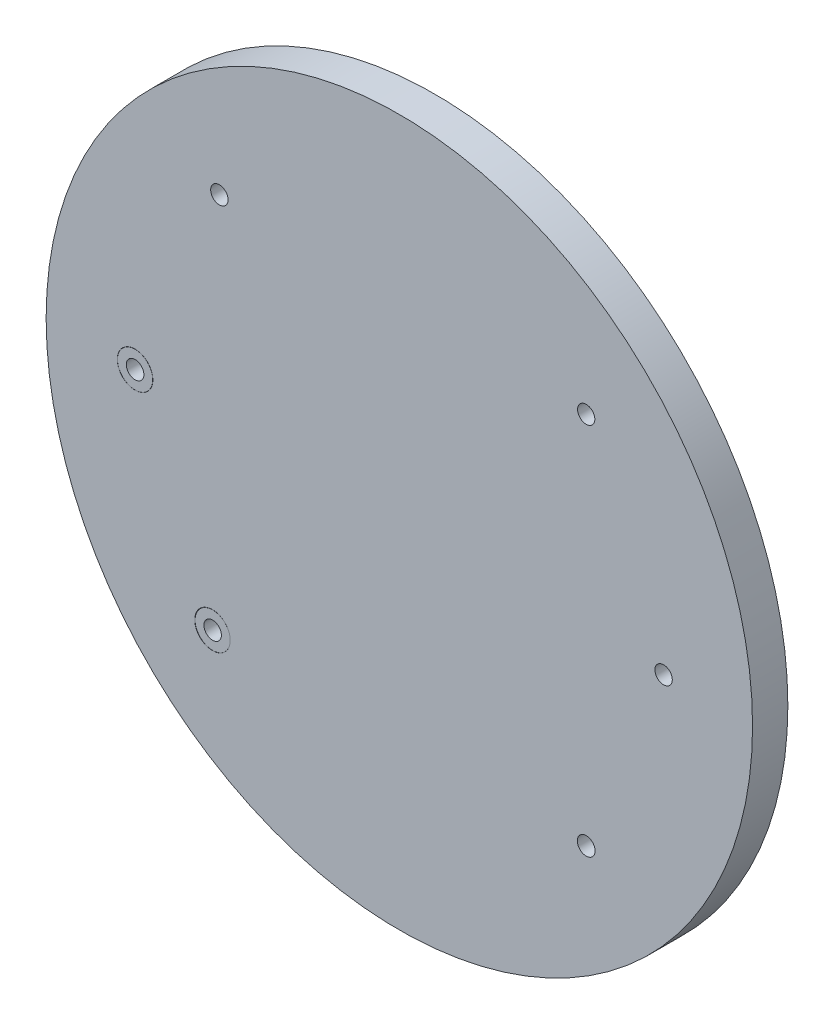
ISO-10303-21;
HEADER;
FILE_DESCRIPTION(('STEP AP214'),'2;1');
FILE_NAME('part.step','',(''),(''),'','','');
FILE_SCHEMA(('AUTOMOTIVE_DESIGN { 1 0 10303 214 1 1 1 1 }'));
ENDSEC;
DATA;
#1=APPLICATION_CONTEXT('core data for automotive mechanical design processes');
#2=APPLICATION_PROTOCOL_DEFINITION('international standard','automotive_design',2000,#1);
#3=PRODUCT_CONTEXT('',#1,'mechanical');
#4=PRODUCT('Part','Part','',(#3));
#5=PRODUCT_RELATED_PRODUCT_CATEGORY('part','',(#4));
#6=PRODUCT_DEFINITION_FORMATION('','',#4);
#7=PRODUCT_DEFINITION_CONTEXT('part definition',#1,'design');
#8=PRODUCT_DEFINITION('design','',#6,#7);
#9=PRODUCT_DEFINITION_SHAPE('','',#8);
#10=(LENGTH_UNIT() NAMED_UNIT(*) SI_UNIT(.MILLI.,.METRE.));
#11=(NAMED_UNIT(*) PLANE_ANGLE_UNIT() SI_UNIT($,.RADIAN.));
#12=(NAMED_UNIT(*) SI_UNIT($,.STERADIAN.) SOLID_ANGLE_UNIT());
#13=UNCERTAINTY_MEASURE_WITH_UNIT(LENGTH_MEASURE(1.E-05),#10,'distance_accuracy_value','');
#14=(GEOMETRIC_REPRESENTATION_CONTEXT(3) GLOBAL_UNCERTAINTY_ASSIGNED_CONTEXT((#13)) GLOBAL_UNIT_ASSIGNED_CONTEXT((#10,
#11,#12)) REPRESENTATION_CONTEXT('',''));
#15=CARTESIAN_POINT('',(0.,0.,0.));
#16=DIRECTION('',(0.,0.,1.));
#17=DIRECTION('',(1.,0.,0.));
#18=AXIS2_PLACEMENT_3D('',#15,#16,#17);
#19=CARTESIAN_POINT('',(-52.8757451291084,-52.9241741656819,10.));
#20=DIRECTION('',(0.,0.,-1.));
#21=DIRECTION('',(-1.,0.,0.));
#22=AXIS2_PLACEMENT_3D('',#19,#20,#21);
#23=CYLINDRICAL_SURFACE('',#22,4.97625214476829);
#24=CARTESIAN_POINT('',(-52.8757451291084,-52.9241741656819,10.));
#25=DIRECTION('',(0.,0.,-1.));
#26=DIRECTION('',(-1.,0.,0.));
#27=AXIS2_PLACEMENT_3D('',#24,#25,#26);
#28=CIRCLE('',#27,4.97625214476829);
#29=CARTESIAN_POINT('',(-57.8519972738767,-52.9241741656819,10.));
#30=VERTEX_POINT('',#29);
#31=EDGE_CURVE('E11',#30,#30,#28,.T.);
#32=ORIENTED_EDGE('',*,*,#31,.T.);
#33=EDGE_LOOP('',(#32));
#34=FACE_BOUND('',#33,.T.);
#35=CARTESIAN_POINT('',(-52.8757451291084,-52.9241741656819,0.));
#36=DIRECTION('',(0.,0.,-1.));
#37=DIRECTION('',(-1.,0.,0.));
#38=AXIS2_PLACEMENT_3D('',#35,#36,#37);
#39=CIRCLE('',#38,4.97625214476829);
#40=CARTESIAN_POINT('',(-57.8519972738767,-52.9241741656819,0.));
#41=VERTEX_POINT('',#40);
#42=EDGE_CURVE('E44',#41,#41,#39,.T.);
#43=ORIENTED_EDGE('',*,*,#42,.F.);
#44=EDGE_LOOP('',(#43));
#45=FACE_BOUND('',#44,.T.);
#46=ADVANCED_FACE('F41',(#34,#45),#23,.T.);
#47=CARTESIAN_POINT('',(-52.8757451291084,-52.9241741656819,10.));
#48=DIRECTION('',(0.,0.,-1.));
#49=DIRECTION('',(-1.,0.,0.));
#50=AXIS2_PLACEMENT_3D('',#47,#48,#49);
#51=PLANE('',#50);
#52=CARTESIAN_POINT('',(-52.8757451291084,-52.9241741656819,10.));
#53=DIRECTION('',(0.,0.,-1.));
#54=DIRECTION('',(-1.,0.,0.));
#55=AXIS2_PLACEMENT_3D('',#52,#53,#54);
#56=CIRCLE('',#55,2.47279609741017);
#57=CARTESIAN_POINT('',(-55.3485412265185,-52.9241741656819,10.));
#58=VERTEX_POINT('',#57);
#59=EDGE_CURVE('E51',#58,#58,#56,.T.);
#60=ORIENTED_EDGE('',*,*,#59,.T.);
#61=EDGE_LOOP('',(#60));
#62=FACE_BOUND('',#61,.T.);
#63=ORIENTED_EDGE('',*,*,#31,.F.);
#64=EDGE_LOOP('',(#63));
#65=FACE_BOUND('',#64,.T.);
#66=ADVANCED_FACE('F59',(#62,#65),#51,.F.);
#67=CARTESIAN_POINT('',(-52.8757451291084,-52.9241741656819,0.));
#68=DIRECTION('',(0.,0.,-1.));
#69=DIRECTION('',(-1.,0.,0.));
#70=AXIS2_PLACEMENT_3D('',#67,#68,#69);
#71=PLANE('',#70);
#72=CARTESIAN_POINT('',(-52.8757451291084,-52.9241741656819,0.));
#73=DIRECTION('',(0.,0.,-1.));
#74=DIRECTION('',(-1.,0.,0.));
#75=AXIS2_PLACEMENT_3D('',#72,#73,#74);
#76=CIRCLE('',#75,2.47279609741017);
#77=CARTESIAN_POINT('',(-55.3485412265185,-52.9241741656819,0.));
#78=VERTEX_POINT('',#77);
#79=EDGE_CURVE('E53',#78,#78,#76,.T.);
#80=ORIENTED_EDGE('',*,*,#79,.F.);
#81=EDGE_LOOP('',(#80));
#82=FACE_BOUND('',#81,.T.);
#83=ORIENTED_EDGE('',*,*,#42,.T.);
#84=EDGE_LOOP('',(#83));
#85=FACE_BOUND('',#84,.T.);
#86=ADVANCED_FACE('F65',(#82,#85),#71,.T.);
#87=CARTESIAN_POINT('',(-52.8757451291084,-52.9241741656819,10.));
#88=DIRECTION('',(0.,0.,-1.));
#89=DIRECTION('',(-1.,0.,0.));
#90=AXIS2_PLACEMENT_3D('',#87,#88,#89);
#91=CYLINDRICAL_SURFACE('',#90,2.47279609741017);
#92=ORIENTED_EDGE('',*,*,#59,.F.);
#93=EDGE_LOOP('',(#92));
#94=FACE_BOUND('',#93,.T.);
#95=ORIENTED_EDGE('',*,*,#79,.T.);
#96=EDGE_LOOP('',(#95));
#97=FACE_BOUND('',#96,.T.);
#98=ADVANCED_FACE('F62',(#94,#97),#91,.F.);
#99=CLOSED_SHELL('',(#46,#66,#86,#98));
#100=MANIFOLD_SOLID_BREP('B2',#99);
#101=CARTESIAN_POINT('',(-74.846084882504,0.,10.));
#102=DIRECTION('',(0.,0.,-1.));
#103=DIRECTION('',(-1.,0.,0.));
#104=AXIS2_PLACEMENT_3D('',#101,#102,#103);
#105=CYLINDRICAL_SURFACE('',#104,4.99002403479634);
#106=CARTESIAN_POINT('',(-74.846084882504,0.,10.));
#107=DIRECTION('',(0.,0.,-1.));
#108=DIRECTION('',(-1.,0.,0.));
#109=AXIS2_PLACEMENT_3D('',#106,#107,#108);
#110=CIRCLE('',#109,4.99002403479634);
#111=CARTESIAN_POINT('',(-79.8361089173003,0.,10.));
#112=VERTEX_POINT('',#111);
#113=EDGE_CURVE('E40',#112,#112,#110,.T.);
#114=ORIENTED_EDGE('',*,*,#113,.T.);
#115=EDGE_LOOP('',(#114));
#116=FACE_BOUND('',#115,.T.);
#117=CARTESIAN_POINT('',(-74.846084882504,0.,0.));
#118=DIRECTION('',(0.,0.,-1.));
#119=DIRECTION('',(-1.,0.,0.));
#120=AXIS2_PLACEMENT_3D('',#117,#118,#119);
#121=CIRCLE('',#120,4.99002403479634);
#122=CARTESIAN_POINT('',(-79.8361089173003,0.,0.));
#123=VERTEX_POINT('',#122);
#124=EDGE_CURVE('E114',#123,#123,#121,.T.);
#125=ORIENTED_EDGE('',*,*,#124,.F.);
#126=EDGE_LOOP('',(#125));
#127=FACE_BOUND('',#126,.T.);
#128=ADVANCED_FACE('F111',(#116,#127),#105,.T.);
#129=CARTESIAN_POINT('',(-74.846084882504,0.,10.));
#130=DIRECTION('',(0.,0.,-1.));
#131=DIRECTION('',(-1.,0.,0.));
#132=AXIS2_PLACEMENT_3D('',#129,#130,#131);
#133=PLANE('',#132);
#134=CARTESIAN_POINT('',(-74.846084882504,0.,10.));
#135=DIRECTION('',(0.,0.,-1.));
#136=DIRECTION('',(-1.,0.,0.));
#137=AXIS2_PLACEMENT_3D('',#134,#135,#136);
#138=CIRCLE('',#137,2.49530974134028);
#139=CARTESIAN_POINT('',(-77.3413946238443,0.,10.));
#140=VERTEX_POINT('',#139);
#141=EDGE_CURVE('E121',#140,#140,#138,.T.);
#142=ORIENTED_EDGE('',*,*,#141,.T.);
#143=EDGE_LOOP('',(#142));
#144=FACE_BOUND('',#143,.T.);
#145=ORIENTED_EDGE('',*,*,#113,.F.);
#146=EDGE_LOOP('',(#145));
#147=FACE_BOUND('',#146,.T.);
#148=ADVANCED_FACE('F129',(#144,#147),#133,.F.);
#149=CARTESIAN_POINT('',(-74.846084882504,0.,0.));
#150=DIRECTION('',(0.,0.,-1.));
#151=DIRECTION('',(-1.,0.,0.));
#152=AXIS2_PLACEMENT_3D('',#149,#150,#151);
#153=PLANE('',#152);
#154=CARTESIAN_POINT('',(-74.846084882504,0.,0.));
#155=DIRECTION('',(0.,0.,-1.));
#156=DIRECTION('',(-1.,0.,0.));
#157=AXIS2_PLACEMENT_3D('',#154,#155,#156);
#158=CIRCLE('',#157,2.49530974134028);
#159=CARTESIAN_POINT('',(-77.3413946238443,0.,0.));
#160=VERTEX_POINT('',#159);
#161=EDGE_CURVE('E123',#160,#160,#158,.T.);
#162=ORIENTED_EDGE('',*,*,#161,.F.);
#163=EDGE_LOOP('',(#162));
#164=FACE_BOUND('',#163,.T.);
#165=ORIENTED_EDGE('',*,*,#124,.T.);
#166=EDGE_LOOP('',(#165));
#167=FACE_BOUND('',#166,.T.);
#168=ADVANCED_FACE('F135',(#164,#167),#153,.T.);
#169=CARTESIAN_POINT('',(-74.846084882504,0.,10.));
#170=DIRECTION('',(0.,0.,-1.));
#171=DIRECTION('',(-1.,0.,0.));
#172=AXIS2_PLACEMENT_3D('',#169,#170,#171);
#173=CYLINDRICAL_SURFACE('',#172,2.49530974134028);
#174=ORIENTED_EDGE('',*,*,#141,.F.);
#175=EDGE_LOOP('',(#174));
#176=FACE_BOUND('',#175,.T.);
#177=ORIENTED_EDGE('',*,*,#161,.T.);
#178=EDGE_LOOP('',(#177));
#179=FACE_BOUND('',#178,.T.);
#180=ADVANCED_FACE('F132',(#176,#179),#173,.F.);
#181=CLOSED_SHELL('',(#128,#148,#168,#180));
#182=MANIFOLD_SOLID_BREP('B6',#181);
#183=CARTESIAN_POINT('',(0.,0.,10.));
#184=DIRECTION('',(0.,0.,1.));
#185=DIRECTION('',(1.,0.,0.));
#186=AXIS2_PLACEMENT_3D('',#183,#184,#185);
#187=PLANE('',#186);
#188=CARTESIAN_POINT('',(-74.846084882504,0.,10.));
#189=DIRECTION('',(0.,0.,1.));
#190=DIRECTION('',(1.,0.,0.));
#191=AXIS2_PLACEMENT_3D('',#188,#189,#190);
#192=CIRCLE('',#191,5.03442961370901);
#193=CARTESIAN_POINT('',(-69.811655268795,0.,10.));
#194=VERTEX_POINT('',#193);
#195=EDGE_CURVE('E190',#194,#194,#192,.T.);
#196=ORIENTED_EDGE('',*,*,#195,.F.);
#197=EDGE_LOOP('',(#196));
#198=FACE_BOUND('',#197,.T.);
#199=CARTESIAN_POINT('',(0.,0.,10.));
#200=DIRECTION('',(0.,0.,1.));
#201=DIRECTION('',(1.,0.,0.));
#202=AXIS2_PLACEMENT_3D('',#199,#200,#201);
#203=CIRCLE('',#202,100.040239398988);
#204=CARTESIAN_POINT('',(100.040239398988,0.,10.));
#205=VERTEX_POINT('',#204);
#206=EDGE_CURVE('E110',#205,#205,#203,.T.);
#207=ORIENTED_EDGE('',*,*,#206,.T.);
#208=EDGE_LOOP('',(#207));
#209=FACE_BOUND('',#208,.T.);
#210=CARTESIAN_POINT('',(-52.9241741656809,-52.9241741656819,10.));
#211=DIRECTION('',(0.,0.,1.));
#212=DIRECTION('',(1.,0.,0.));
#213=AXIS2_PLACEMENT_3D('',#210,#211,#212);
#214=CIRCLE('',#213,5.02468118134085);
#215=CARTESIAN_POINT('',(-47.8994929843401,-52.9241741656819,10.));
#216=VERTEX_POINT('',#215);
#217=EDGE_CURVE('E185',#216,#216,#214,.T.);
#218=ORIENTED_EDGE('',*,*,#217,.F.);
#219=EDGE_LOOP('',(#218));
#220=FACE_BOUND('',#219,.T.);
#221=CARTESIAN_POINT('',(74.846084882504,0.,10.));
#222=DIRECTION('',(0.,0.,-1.));
#223=DIRECTION('',(-1.,0.,0.));
#224=AXIS2_PLACEMENT_3D('',#221,#222,#223);
#225=CIRCLE('',#224,2.4629505254818);
#226=CARTESIAN_POINT('',(72.3831343570222,0.,10.));
#227=VERTEX_POINT('',#226);
#228=EDGE_CURVE('E196',#227,#227,#225,.T.);
#229=ORIENTED_EDGE('',*,*,#228,.T.);
#230=EDGE_LOOP('',(#229));
#231=FACE_BOUND('',#230,.T.);
#232=CARTESIAN_POINT('',(52.9241741656831,-52.9241741656819,10.));
#233=DIRECTION('',(0.,0.,-1.));
#234=DIRECTION('',(-1.,0.,0.));
#235=AXIS2_PLACEMENT_3D('',#232,#233,#234);
#236=CIRCLE('',#235,2.5198995692749);
#237=CARTESIAN_POINT('',(50.4042745964082,-52.9241741656819,10.));
#238=VERTEX_POINT('',#237);
#239=EDGE_CURVE('E202',#238,#238,#236,.T.);
#240=ORIENTED_EDGE('',*,*,#239,.T.);
#241=EDGE_LOOP('',(#240));
#242=FACE_BOUND('',#241,.T.);
#243=CARTESIAN_POINT('',(-50.96624125,54.8122128278525,10.));
#244=DIRECTION('',(0.,0.,-1.));
#245=DIRECTION('',(-1.,0.,0.));
#246=AXIS2_PLACEMENT_3D('',#243,#244,#245);
#247=CIRCLE('',#246,2.47251265517642);
#248=CARTESIAN_POINT('',(-53.4387539051764,54.8122128278525,10.));
#249=VERTEX_POINT('',#248);
#250=EDGE_CURVE('E208',#249,#249,#247,.T.);
#251=ORIENTED_EDGE('',*,*,#250,.T.);
#252=EDGE_LOOP('',(#251));
#253=FACE_BOUND('',#252,.T.);
#254=CARTESIAN_POINT('',(52.9241741656831,52.9241741656826,10.));
#255=DIRECTION('',(0.,0.,-1.));
#256=DIRECTION('',(-1.,0.,0.));
#257=AXIS2_PLACEMENT_3D('',#254,#255,#256);
#258=CIRCLE('',#257,2.44732602665758);
#259=CARTESIAN_POINT('',(50.4768481390256,52.9241741656826,10.));
#260=VERTEX_POINT('',#259);
#261=EDGE_CURVE('E214',#260,#260,#258,.T.);
#262=ORIENTED_EDGE('',*,*,#261,.T.);
#263=EDGE_LOOP('',(#262));
#264=FACE_BOUND('',#263,.T.);
#265=ADVANCED_FACE('F174',(#198,#209,#220,#231,#242,#253,#264),#187,.T.);
#266=CARTESIAN_POINT('',(0.,0.,0.));
#267=DIRECTION('',(0.,0.,1.));
#268=DIRECTION('',(1.,0.,0.));
#269=AXIS2_PLACEMENT_3D('',#266,#267,#268);
#270=PLANE('',#269);
#271=CARTESIAN_POINT('',(-74.846084882504,0.,0.));
#272=DIRECTION('',(0.,0.,1.));
#273=DIRECTION('',(1.,0.,0.));
#274=AXIS2_PLACEMENT_3D('',#271,#272,#273);
#275=CIRCLE('',#274,5.03442961370901);
#276=CARTESIAN_POINT('',(-69.811655268795,0.,0.));
#277=VERTEX_POINT('',#276);
#278=EDGE_CURVE('E193',#277,#277,#275,.T.);
#279=ORIENTED_EDGE('',*,*,#278,.T.);
#280=EDGE_LOOP('',(#279));
#281=FACE_BOUND('',#280,.T.);
#282=CARTESIAN_POINT('',(0.,0.,0.));
#283=DIRECTION('',(0.,0.,1.));
#284=DIRECTION('',(1.,0.,0.));
#285=AXIS2_PLACEMENT_3D('',#282,#283,#284);
#286=CIRCLE('',#285,100.040239398988);
#287=CARTESIAN_POINT('',(100.040239398988,0.,0.));
#288=VERTEX_POINT('',#287);
#289=EDGE_CURVE('E178',#288,#288,#286,.T.);
#290=ORIENTED_EDGE('',*,*,#289,.F.);
#291=EDGE_LOOP('',(#290));
#292=FACE_BOUND('',#291,.T.);
#293=CARTESIAN_POINT('',(-52.9241741656809,-52.9241741656819,0.));
#294=DIRECTION('',(0.,0.,1.));
#295=DIRECTION('',(1.,0.,0.));
#296=AXIS2_PLACEMENT_3D('',#293,#294,#295);
#297=CIRCLE('',#296,5.02468118134085);
#298=CARTESIAN_POINT('',(-47.8994929843401,-52.9241741656819,0.));
#299=VERTEX_POINT('',#298);
#300=EDGE_CURVE('E187',#299,#299,#297,.T.);
#301=ORIENTED_EDGE('',*,*,#300,.T.);
#302=EDGE_LOOP('',(#301));
#303=FACE_BOUND('',#302,.T.);
#304=CARTESIAN_POINT('',(74.846084882504,0.,0.));
#305=DIRECTION('',(0.,0.,-1.));
#306=DIRECTION('',(-1.,0.,0.));
#307=AXIS2_PLACEMENT_3D('',#304,#305,#306);
#308=CIRCLE('',#307,2.4629505254818);
#309=CARTESIAN_POINT('',(72.3831343570222,0.,0.));
#310=VERTEX_POINT('',#309);
#311=EDGE_CURVE('E199',#310,#310,#308,.T.);
#312=ORIENTED_EDGE('',*,*,#311,.F.);
#313=EDGE_LOOP('',(#312));
#314=FACE_BOUND('',#313,.T.);
#315=CARTESIAN_POINT('',(52.9241741656831,-52.9241741656819,0.));
#316=DIRECTION('',(0.,0.,-1.));
#317=DIRECTION('',(-1.,0.,0.));
#318=AXIS2_PLACEMENT_3D('',#315,#316,#317);
#319=CIRCLE('',#318,2.5198995692749);
#320=CARTESIAN_POINT('',(50.4042745964082,-52.9241741656819,0.));
#321=VERTEX_POINT('',#320);
#322=EDGE_CURVE('E205',#321,#321,#319,.T.);
#323=ORIENTED_EDGE('',*,*,#322,.F.);
#324=EDGE_LOOP('',(#323));
#325=FACE_BOUND('',#324,.T.);
#326=CARTESIAN_POINT('',(-50.96624125,54.8122128278525,0.));
#327=DIRECTION('',(0.,0.,-1.));
#328=DIRECTION('',(-1.,0.,0.));
#329=AXIS2_PLACEMENT_3D('',#326,#327,#328);
#330=CIRCLE('',#329,2.47251265517642);
#331=CARTESIAN_POINT('',(-53.4387539051764,54.8122128278525,0.));
#332=VERTEX_POINT('',#331);
#333=EDGE_CURVE('E211',#332,#332,#330,.T.);
#334=ORIENTED_EDGE('',*,*,#333,.F.);
#335=EDGE_LOOP('',(#334));
#336=FACE_BOUND('',#335,.T.);
#337=CARTESIAN_POINT('',(52.9241741656831,52.9241741656826,0.));
#338=DIRECTION('',(0.,0.,-1.));
#339=DIRECTION('',(-1.,0.,0.));
#340=AXIS2_PLACEMENT_3D('',#337,#338,#339);
#341=CIRCLE('',#340,2.44732602665758);
#342=CARTESIAN_POINT('',(50.4768481390256,52.9241741656826,0.));
#343=VERTEX_POINT('',#342);
#344=EDGE_CURVE('E217',#343,#343,#341,.T.);
#345=ORIENTED_EDGE('',*,*,#344,.F.);
#346=EDGE_LOOP('',(#345));
#347=FACE_BOUND('',#346,.T.);
#348=ADVANCED_FACE('F231',(#281,#292,#303,#314,#325,#336,#347),#270,.F.);
#349=CARTESIAN_POINT('',(0.,0.,10.));
#350=DIRECTION('',(0.,0.,-1.));
#351=DIRECTION('',(-1.,0.,0.));
#352=AXIS2_PLACEMENT_3D('',#349,#350,#351);
#353=CYLINDRICAL_SURFACE('',#352,100.040239398988);
#354=ORIENTED_EDGE('',*,*,#206,.F.);
#355=EDGE_LOOP('',(#354));
#356=FACE_BOUND('',#355,.T.);
#357=ORIENTED_EDGE('',*,*,#289,.T.);
#358=EDGE_LOOP('',(#357));
#359=FACE_BOUND('',#358,.T.);
#360=ADVANCED_FACE('F176',(#356,#359),#353,.T.);
#361=CARTESIAN_POINT('',(-52.9241741656809,-52.9241741656819,10.));
#362=DIRECTION('',(0.,0.,-1.));
#363=DIRECTION('',(-1.,0.,0.));
#364=AXIS2_PLACEMENT_3D('',#361,#362,#363);
#365=CYLINDRICAL_SURFACE('',#364,5.02468118134085);
#366=ORIENTED_EDGE('',*,*,#300,.F.);
#367=EDGE_LOOP('',(#366));
#368=FACE_BOUND('',#367,.T.);
#369=ORIENTED_EDGE('',*,*,#217,.T.);
#370=EDGE_LOOP('',(#369));
#371=FACE_BOUND('',#370,.T.);
#372=ADVANCED_FACE('F238',(#368,#371),#365,.F.);
#373=CARTESIAN_POINT('',(-74.846084882504,0.,10.));
#374=DIRECTION('',(0.,0.,-1.));
#375=DIRECTION('',(-1.,0.,0.));
#376=AXIS2_PLACEMENT_3D('',#373,#374,#375);
#377=CYLINDRICAL_SURFACE('',#376,5.03442961370901);
#378=ORIENTED_EDGE('',*,*,#195,.T.);
#379=EDGE_LOOP('',(#378));
#380=FACE_BOUND('',#379,.T.);
#381=ORIENTED_EDGE('',*,*,#278,.F.);
#382=EDGE_LOOP('',(#381));
#383=FACE_BOUND('',#382,.T.);
#384=ADVANCED_FACE('F246',(#380,#383),#377,.F.);
#385=CARTESIAN_POINT('',(74.846084882504,0.,10.));
#386=DIRECTION('',(0.,0.,-1.));
#387=DIRECTION('',(-1.,0.,0.));
#388=AXIS2_PLACEMENT_3D('',#385,#386,#387);
#389=CYLINDRICAL_SURFACE('',#388,2.4629505254818);
#390=ORIENTED_EDGE('',*,*,#228,.F.);
#391=EDGE_LOOP('',(#390));
#392=FACE_BOUND('',#391,.T.);
#393=ORIENTED_EDGE('',*,*,#311,.T.);
#394=EDGE_LOOP('',(#393));
#395=FACE_BOUND('',#394,.T.);
#396=ADVANCED_FACE('F250',(#392,#395),#389,.F.);
#397=CARTESIAN_POINT('',(52.9241741656831,-52.9241741656819,10.));
#398=DIRECTION('',(0.,0.,-1.));
#399=DIRECTION('',(-1.,0.,0.));
#400=AXIS2_PLACEMENT_3D('',#397,#398,#399);
#401=CYLINDRICAL_SURFACE('',#400,2.5198995692749);
#402=ORIENTED_EDGE('',*,*,#239,.F.);
#403=EDGE_LOOP('',(#402));
#404=FACE_BOUND('',#403,.T.);
#405=ORIENTED_EDGE('',*,*,#322,.T.);
#406=EDGE_LOOP('',(#405));
#407=FACE_BOUND('',#406,.T.);
#408=ADVANCED_FACE('F254',(#404,#407),#401,.F.);
#409=CARTESIAN_POINT('',(-50.96624125,54.8122128278525,10.));
#410=DIRECTION('',(0.,0.,-1.));
#411=DIRECTION('',(-1.,0.,0.));
#412=AXIS2_PLACEMENT_3D('',#409,#410,#411);
#413=CYLINDRICAL_SURFACE('',#412,2.47251265517642);
#414=ORIENTED_EDGE('',*,*,#250,.F.);
#415=EDGE_LOOP('',(#414));
#416=FACE_BOUND('',#415,.T.);
#417=ORIENTED_EDGE('',*,*,#333,.T.);
#418=EDGE_LOOP('',(#417));
#419=FACE_BOUND('',#418,.T.);
#420=ADVANCED_FACE('F227',(#416,#419),#413,.F.);
#421=CARTESIAN_POINT('',(52.9241741656831,52.9241741656826,10.));
#422=DIRECTION('',(0.,0.,-1.));
#423=DIRECTION('',(-1.,0.,0.));
#424=AXIS2_PLACEMENT_3D('',#421,#422,#423);
#425=CYLINDRICAL_SURFACE('',#424,2.44732602665758);
#426=ORIENTED_EDGE('',*,*,#261,.F.);
#427=EDGE_LOOP('',(#426));
#428=FACE_BOUND('',#427,.T.);
#429=ORIENTED_EDGE('',*,*,#344,.T.);
#430=EDGE_LOOP('',(#429));
#431=FACE_BOUND('',#430,.T.);
#432=ADVANCED_FACE('F224',(#428,#431),#425,.F.);
#433=CLOSED_SHELL('',(#265,#348,#360,#372,#384,#396,#408,#420,#432));
#434=MANIFOLD_SOLID_BREP('B35',#433);
#435=ADVANCED_BREP_SHAPE_REPRESENTATION('',(#18,#100,#182,#434),#14);
#436=SHAPE_DEFINITION_REPRESENTATION(#9,#435);
ENDSEC;
END-ISO-10303-21;
